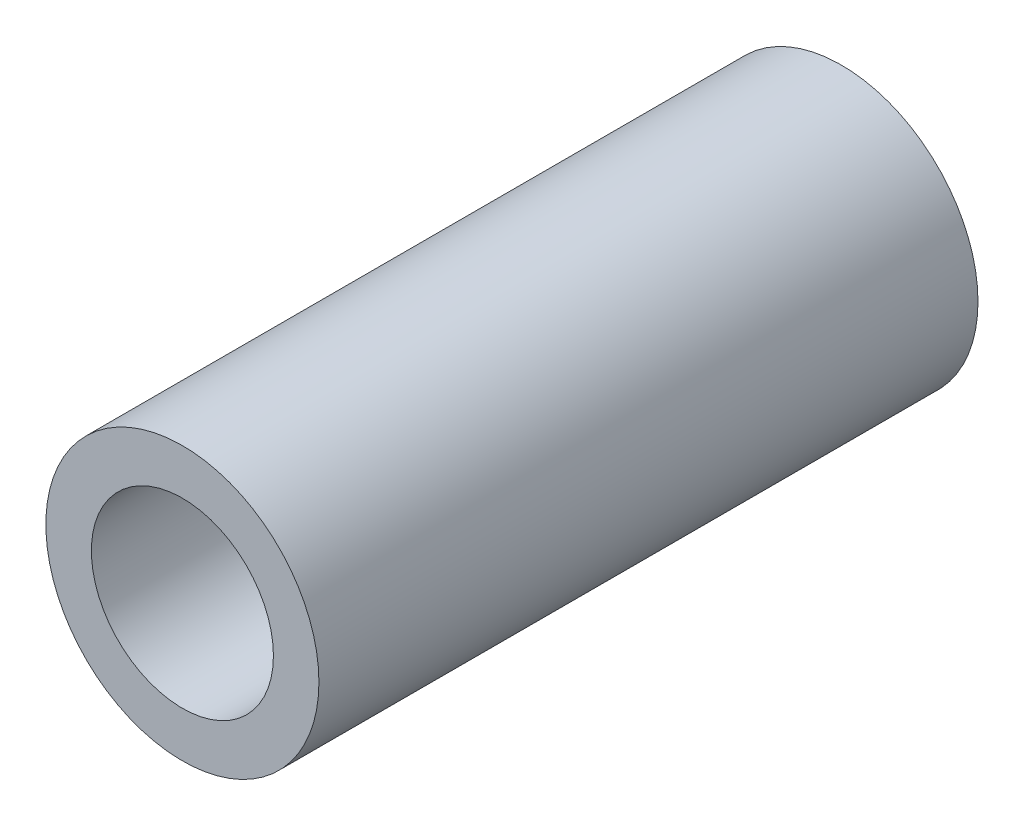
ISO-10303-21;
HEADER;
FILE_DESCRIPTION(('STEP AP214'),'2;1');
FILE_NAME('part.step','',(''),(''),'','','');
FILE_SCHEMA(('AUTOMOTIVE_DESIGN { 1 0 10303 214 1 1 1 1 }'));
ENDSEC;
DATA;
#1=APPLICATION_CONTEXT('core data for automotive mechanical design processes');
#2=APPLICATION_PROTOCOL_DEFINITION('international standard','automotive_design',2000,#1);
#3=PRODUCT_CONTEXT('',#1,'mechanical');
#4=PRODUCT('Part','Part','',(#3));
#5=PRODUCT_RELATED_PRODUCT_CATEGORY('part','',(#4));
#6=PRODUCT_DEFINITION_FORMATION('','',#4);
#7=PRODUCT_DEFINITION_CONTEXT('part definition',#1,'design');
#8=PRODUCT_DEFINITION('design','',#6,#7);
#9=PRODUCT_DEFINITION_SHAPE('','',#8);
#10=(LENGTH_UNIT() NAMED_UNIT(*) SI_UNIT(.MILLI.,.METRE.));
#11=(NAMED_UNIT(*) PLANE_ANGLE_UNIT() SI_UNIT($,.RADIAN.));
#12=(NAMED_UNIT(*) SI_UNIT($,.STERADIAN.) SOLID_ANGLE_UNIT());
#13=UNCERTAINTY_MEASURE_WITH_UNIT(LENGTH_MEASURE(1.E-05),#10,'distance_accuracy_value','');
#14=(GEOMETRIC_REPRESENTATION_CONTEXT(3) GLOBAL_UNCERTAINTY_ASSIGNED_CONTEXT((#13)) GLOBAL_UNIT_ASSIGNED_CONTEXT((#10,
#11,#12)) REPRESENTATION_CONTEXT('',''));
#15=CARTESIAN_POINT('',(0.,0.,0.));
#16=DIRECTION('',(0.,0.,1.));
#17=DIRECTION('',(1.,0.,0.));
#18=AXIS2_PLACEMENT_3D('',#15,#16,#17);
#19=CARTESIAN_POINT('',(0.,0.,45.974));
#20=DIRECTION('',(0.,0.,1.));
#21=DIRECTION('',(1.,0.,0.));
#22=AXIS2_PLACEMENT_3D('',#19,#20,#21);
#23=PLANE('',#22);
#24=CARTESIAN_POINT('',(0.,0.,45.974));
#25=DIRECTION('',(0.,0.,1.));
#26=DIRECTION('',(1.,0.,0.));
#27=AXIS2_PLACEMENT_3D('',#24,#25,#26);
#28=CIRCLE('',#27,9.525);
#29=CARTESIAN_POINT('',(9.525,0.,45.974));
#30=VERTEX_POINT('',#29);
#31=EDGE_CURVE('E10',#30,#30,#28,.T.);
#32=ORIENTED_EDGE('',*,*,#31,.T.);
#33=EDGE_LOOP('',(#32));
#34=FACE_BOUND('',#33,.T.);
#35=CARTESIAN_POINT('',(0.,0.,45.974));
#36=DIRECTION('',(0.,0.,1.));
#37=DIRECTION('',(1.,0.,0.));
#38=AXIS2_PLACEMENT_3D('',#35,#36,#37);
#39=CIRCLE('',#38,6.35);
#40=CARTESIAN_POINT('',(6.35,0.,45.974));
#41=VERTEX_POINT('',#40);
#42=EDGE_CURVE('E43',#41,#41,#39,.T.);
#43=ORIENTED_EDGE('',*,*,#42,.F.);
#44=EDGE_LOOP('',(#43));
#45=FACE_BOUND('',#44,.T.);
#46=ADVANCED_FACE('F32',(#34,#45),#23,.T.);
#47=CARTESIAN_POINT('',(0.,0.,0.));
#48=DIRECTION('',(0.,0.,1.));
#49=DIRECTION('',(1.,0.,0.));
#50=AXIS2_PLACEMENT_3D('',#47,#48,#49);
#51=PLANE('',#50);
#52=CARTESIAN_POINT('',(0.,0.,0.));
#53=DIRECTION('',(0.,0.,1.));
#54=DIRECTION('',(1.,0.,0.));
#55=AXIS2_PLACEMENT_3D('',#52,#53,#54);
#56=CIRCLE('',#55,9.525);
#57=CARTESIAN_POINT('',(9.525,0.,0.));
#58=VERTEX_POINT('',#57);
#59=EDGE_CURVE('E36',#58,#58,#56,.T.);
#60=ORIENTED_EDGE('',*,*,#59,.F.);
#61=EDGE_LOOP('',(#60));
#62=FACE_BOUND('',#61,.T.);
#63=CARTESIAN_POINT('',(0.,0.,0.));
#64=DIRECTION('',(0.,0.,1.));
#65=DIRECTION('',(1.,0.,0.));
#66=AXIS2_PLACEMENT_3D('',#63,#64,#65);
#67=CIRCLE('',#66,6.35);
#68=CARTESIAN_POINT('',(6.35,0.,0.));
#69=VERTEX_POINT('',#68);
#70=EDGE_CURVE('E45',#69,#69,#67,.T.);
#71=ORIENTED_EDGE('',*,*,#70,.T.);
#72=EDGE_LOOP('',(#71));
#73=FACE_BOUND('',#72,.T.);
#74=ADVANCED_FACE('F55',(#62,#73),#51,.F.);
#75=CARTESIAN_POINT('',(0.,0.,45.974));
#76=DIRECTION('',(0.,0.,-1.));
#77=DIRECTION('',(-1.,0.,0.));
#78=AXIS2_PLACEMENT_3D('',#75,#76,#77);
#79=CYLINDRICAL_SURFACE('',#78,9.525);
#80=ORIENTED_EDGE('',*,*,#31,.F.);
#81=EDGE_LOOP('',(#80));
#82=FACE_BOUND('',#81,.T.);
#83=ORIENTED_EDGE('',*,*,#59,.T.);
#84=EDGE_LOOP('',(#83));
#85=FACE_BOUND('',#84,.T.);
#86=ADVANCED_FACE('F34',(#82,#85),#79,.T.);
#87=CARTESIAN_POINT('',(0.,0.,45.974));
#88=DIRECTION('',(0.,0.,-1.));
#89=DIRECTION('',(-1.,0.,0.));
#90=AXIS2_PLACEMENT_3D('',#87,#88,#89);
#91=CYLINDRICAL_SURFACE('',#90,6.35);
#92=ORIENTED_EDGE('',*,*,#42,.T.);
#93=EDGE_LOOP('',(#92));
#94=FACE_BOUND('',#93,.T.);
#95=ORIENTED_EDGE('',*,*,#70,.F.);
#96=EDGE_LOOP('',(#95));
#97=FACE_BOUND('',#96,.T.);
#98=ADVANCED_FACE('F51',(#94,#97),#91,.F.);
#99=CLOSED_SHELL('',(#46,#74,#86,#98));
#100=MANIFOLD_SOLID_BREP('B2',#99);
#101=ADVANCED_BREP_SHAPE_REPRESENTATION('',(#18,#100),#14);
#102=SHAPE_DEFINITION_REPRESENTATION(#9,#101);
ENDSEC;
END-ISO-10303-21;
